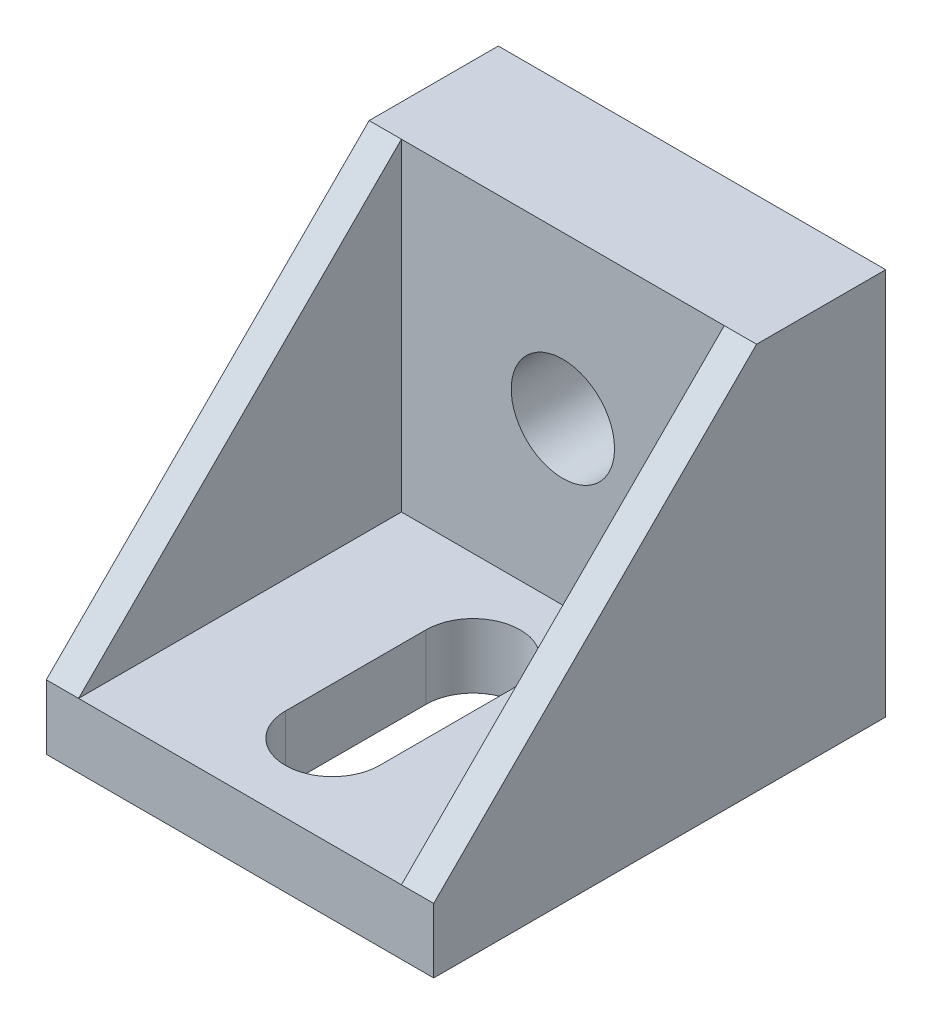
ISO-10303-21;
HEADER;
FILE_DESCRIPTION(('STEP AP214'),'2;1');
FILE_NAME('part.step','',(''),(''),'','','');
FILE_SCHEMA(('AUTOMOTIVE_DESIGN { 1 0 10303 214 1 1 1 1 }'));
ENDSEC;
DATA;
#1=APPLICATION_CONTEXT('core data for automotive mechanical design processes');
#2=APPLICATION_PROTOCOL_DEFINITION('international standard','automotive_design',2000,#1);
#3=PRODUCT_CONTEXT('',#1,'mechanical');
#4=PRODUCT('Part','Part','',(#3));
#5=PRODUCT_RELATED_PRODUCT_CATEGORY('part','',(#4));
#6=PRODUCT_DEFINITION_FORMATION('','',#4);
#7=PRODUCT_DEFINITION_CONTEXT('part definition',#1,'design');
#8=PRODUCT_DEFINITION('design','',#6,#7);
#9=PRODUCT_DEFINITION_SHAPE('','',#8);
#10=(LENGTH_UNIT() NAMED_UNIT(*) SI_UNIT(.MILLI.,.METRE.));
#11=(NAMED_UNIT(*) PLANE_ANGLE_UNIT() SI_UNIT($,.RADIAN.));
#12=(NAMED_UNIT(*) SI_UNIT($,.STERADIAN.) SOLID_ANGLE_UNIT());
#13=UNCERTAINTY_MEASURE_WITH_UNIT(LENGTH_MEASURE(1.E-05),#10,'distance_accuracy_value','');
#14=(GEOMETRIC_REPRESENTATION_CONTEXT(3) GLOBAL_UNCERTAINTY_ASSIGNED_CONTEXT((#13)) GLOBAL_UNIT_ASSIGNED_CONTEXT((#10,
#11,#12)) REPRESENTATION_CONTEXT('',''));
#15=CARTESIAN_POINT('',(0.,0.,0.));
#16=DIRECTION('',(0.,0.,1.));
#17=DIRECTION('',(1.,0.,0.));
#18=AXIS2_PLACEMENT_3D('',#15,#16,#17);
#19=CARTESIAN_POINT('',(0.,0.,10.));
#20=DIRECTION('',(0.,0.,1.));
#21=DIRECTION('',(1.,0.,0.));
#22=AXIS2_PLACEMENT_3D('',#19,#20,#21);
#23=PLANE('',#22);
#24=CARTESIAN_POINT('',(0.,0.,10.));
#25=DIRECTION('',(0.,0.,1.));
#26=DIRECTION('',(1.,0.,0.));
#27=AXIS2_PLACEMENT_3D('',#24,#25,#26);
#28=CIRCLE('',#27,4.);
#29=CARTESIAN_POINT('',(4.,0.,10.));
#30=VERTEX_POINT('',#29);
#31=EDGE_CURVE('E242',#30,#30,#28,.T.);
#32=ORIENTED_EDGE('',*,*,#31,.F.);
#33=EDGE_LOOP('',(#32));
#34=FACE_BOUND('',#33,.T.);
#35=DIRECTION('',(-1.,0.,0.));
#36=VECTOR('',#35,1.);
#37=CARTESIAN_POINT('',(-15.,12.5,10.));
#38=LINE('',#37,#36);
#39=CARTESIAN_POINT('',(12.5,12.5,10.));
#40=VERTEX_POINT('',#39);
#41=CARTESIAN_POINT('',(-12.5,12.5,10.));
#42=VERTEX_POINT('',#41);
#43=EDGE_CURVE('E254',#40,#42,#38,.T.);
#44=ORIENTED_EDGE('',*,*,#43,.T.);
#45=DIRECTION('',(0.,1.,0.));
#46=VECTOR('',#45,1.);
#47=CARTESIAN_POINT('',(-12.5,12.5,10.));
#48=LINE('',#47,#46);
#49=CARTESIAN_POINT('',(-12.5,-12.5,10.));
#50=VERTEX_POINT('',#49);
#51=EDGE_CURVE('E186',#50,#42,#48,.T.);
#52=ORIENTED_EDGE('',*,*,#51,.F.);
#53=DIRECTION('',(1.,0.,0.));
#54=VECTOR('',#53,1.);
#55=CARTESIAN_POINT('',(-15.,-12.5,10.));
#56=LINE('',#55,#54);
#57=CARTESIAN_POINT('',(12.5,-12.5,10.));
#58=VERTEX_POINT('',#57);
#59=EDGE_CURVE('E253',#50,#58,#56,.T.);
#60=ORIENTED_EDGE('',*,*,#59,.T.);
#61=DIRECTION('',(0.,1.,0.));
#62=VECTOR('',#61,1.);
#63=CARTESIAN_POINT('',(12.5,12.5,10.));
#64=LINE('',#63,#62);
#65=EDGE_CURVE('E203',#58,#40,#64,.T.);
#66=ORIENTED_EDGE('',*,*,#65,.T.);
#67=EDGE_LOOP('',(#44,#52,#60,#66));
#68=FACE_BOUND('',#67,.T.);
#69=ADVANCED_FACE('F39',(#34,#68),#23,.T.);
#70=CARTESIAN_POINT('',(0.,-12.5,0.));
#71=DIRECTION('',(0.,-1.,0.));
#72=DIRECTION('',(0.,0.,-1.));
#73=AXIS2_PLACEMENT_3D('',#70,#71,#72);
#74=PLANE('',#73);
#75=DIRECTION('',(0.,0.,-1.));
#76=VECTOR('',#75,1.);
#77=CARTESIAN_POINT('',(-3.64736353506313,-12.5,0.));
#78=LINE('',#77,#76);
#79=CARTESIAN_POINT('',(-3.64736353506313,-12.5,27.8421952869225));
#80=VERTEX_POINT('',#79);
#81=CARTESIAN_POINT('',(-3.64736353506313,-12.5,16.9480963071945));
#82=VERTEX_POINT('',#81);
#83=EDGE_CURVE('E160',#80,#82,#78,.T.);
#84=ORIENTED_EDGE('',*,*,#83,.T.);
#85=CARTESIAN_POINT('',(0.,-12.5,16.9480963071945));
#86=DIRECTION('',(0.,-1.,0.));
#87=DIRECTION('',(0.,0.,-1.));
#88=AXIS2_PLACEMENT_3D('',#85,#86,#87);
#89=CIRCLE('',#88,3.64736353506313);
#90=CARTESIAN_POINT('',(3.64736353506313,-12.5,16.9480963071945));
#91=VERTEX_POINT('',#90);
#92=EDGE_CURVE('E135',#82,#91,#89,.T.);
#93=ORIENTED_EDGE('',*,*,#92,.T.);
#94=DIRECTION('',(0.,0.,1.));
#95=VECTOR('',#94,1.);
#96=CARTESIAN_POINT('',(3.64736353506313,-12.5,0.));
#97=LINE('',#96,#95);
#98=CARTESIAN_POINT('',(3.64736353506313,-12.5,27.8421952869225));
#99=VERTEX_POINT('',#98);
#100=EDGE_CURVE('E173',#91,#99,#97,.T.);
#101=ORIENTED_EDGE('',*,*,#100,.T.);
#102=CARTESIAN_POINT('',(0.,-12.5,27.8421952869225));
#103=DIRECTION('',(0.,-1.,0.));
#104=DIRECTION('',(0.,0.,-1.));
#105=AXIS2_PLACEMENT_3D('',#102,#103,#104);
#106=CIRCLE('',#105,3.64736353506313);
#107=EDGE_CURVE('E169',#99,#80,#106,.T.);
#108=ORIENTED_EDGE('',*,*,#107,.T.);
#109=EDGE_LOOP('',(#84,#93,#101,#108));
#110=FACE_BOUND('',#109,.T.);
#111=DIRECTION('',(0.,0.,-1.));
#112=VECTOR('',#111,1.);
#113=CARTESIAN_POINT('',(-12.5,-12.5,10.));
#114=LINE('',#113,#112);
#115=CARTESIAN_POINT('',(-12.5,-12.5,35.));
#116=VERTEX_POINT('',#115);
#117=EDGE_CURVE('E180',#116,#50,#114,.T.);
#118=ORIENTED_EDGE('',*,*,#117,.F.);
#119=DIRECTION('',(-1.,0.,0.));
#120=VECTOR('',#119,1.);
#121=CARTESIAN_POINT('',(-15.,-12.5,35.));
#122=LINE('',#121,#120);
#123=CARTESIAN_POINT('',(12.5,-12.5,35.));
#124=VERTEX_POINT('',#123);
#125=EDGE_CURVE('E211',#124,#116,#122,.T.);
#126=ORIENTED_EDGE('',*,*,#125,.F.);
#127=DIRECTION('',(0.,0.,-1.));
#128=VECTOR('',#127,1.);
#129=CARTESIAN_POINT('',(12.5,-12.5,10.));
#130=LINE('',#129,#128);
#131=EDGE_CURVE('E199',#124,#58,#130,.T.);
#132=ORIENTED_EDGE('',*,*,#131,.T.);
#133=ORIENTED_EDGE('',*,*,#59,.F.);
#134=EDGE_LOOP('',(#118,#126,#132,#133));
#135=FACE_BOUND('',#134,.T.);
#136=ADVANCED_FACE('F296',(#110,#135),#74,.F.);
#137=CARTESIAN_POINT('',(0.,0.,0.));
#138=DIRECTION('',(0.,0.,1.));
#139=DIRECTION('',(1.,0.,0.));
#140=AXIS2_PLACEMENT_3D('',#137,#138,#139);
#141=PLANE('',#140);
#142=DIRECTION('',(0.,1.,0.));
#143=VECTOR('',#142,1.);
#144=CARTESIAN_POINT('',(15.,12.5,0.));
#145=LINE('',#144,#143);
#146=CARTESIAN_POINT('',(15.,-17.5,0.));
#147=VERTEX_POINT('',#146);
#148=CARTESIAN_POINT('',(15.,12.5,0.));
#149=VERTEX_POINT('',#148);
#150=EDGE_CURVE('E246',#147,#149,#145,.T.);
#151=ORIENTED_EDGE('',*,*,#150,.F.);
#152=DIRECTION('',(1.,0.,0.));
#153=VECTOR('',#152,1.);
#154=CARTESIAN_POINT('',(-15.,-17.5,0.));
#155=LINE('',#154,#153);
#156=CARTESIAN_POINT('',(-15.,-17.5,0.));
#157=VERTEX_POINT('',#156);
#158=EDGE_CURVE('E226',#157,#147,#155,.T.);
#159=ORIENTED_EDGE('',*,*,#158,.F.);
#160=DIRECTION('',(0.,-1.,0.));
#161=VECTOR('',#160,1.);
#162=CARTESIAN_POINT('',(-15.,12.5,0.));
#163=LINE('',#162,#161);
#164=CARTESIAN_POINT('',(-15.,12.5,0.));
#165=VERTEX_POINT('',#164);
#166=EDGE_CURVE('E263',#165,#157,#163,.T.);
#167=ORIENTED_EDGE('',*,*,#166,.F.);
#168=DIRECTION('',(-1.,0.,0.));
#169=VECTOR('',#168,1.);
#170=CARTESIAN_POINT('',(-15.,12.5,0.));
#171=LINE('',#170,#169);
#172=EDGE_CURVE('E260',#149,#165,#171,.T.);
#173=ORIENTED_EDGE('',*,*,#172,.F.);
#174=EDGE_LOOP('',(#151,#159,#167,#173));
#175=FACE_BOUND('',#174,.T.);
#176=CARTESIAN_POINT('',(0.,0.,0.));
#177=DIRECTION('',(0.,0.,1.));
#178=DIRECTION('',(1.,0.,0.));
#179=AXIS2_PLACEMENT_3D('',#176,#177,#178);
#180=CIRCLE('',#179,4.);
#181=CARTESIAN_POINT('',(4.,0.,0.));
#182=VERTEX_POINT('',#181);
#183=EDGE_CURVE('E241',#182,#182,#180,.T.);
#184=ORIENTED_EDGE('',*,*,#183,.T.);
#185=EDGE_LOOP('',(#184));
#186=FACE_BOUND('',#185,.T.);
#187=ADVANCED_FACE('F277',(#175,#186),#141,.F.);
#188=CARTESIAN_POINT('',(15.,12.5,10.));
#189=DIRECTION('',(-1.,0.,0.));
#190=DIRECTION('',(0.,-1.,0.));
#191=AXIS2_PLACEMENT_3D('',#188,#189,#190);
#192=PLANE('',#191);
#193=DIRECTION('',(0.,0.,-1.));
#194=VECTOR('',#193,1.);
#195=CARTESIAN_POINT('',(15.,12.5,10.));
#196=LINE('',#195,#194);
#197=CARTESIAN_POINT('',(15.,12.5,10.));
#198=VERTEX_POINT('',#197);
#199=EDGE_CURVE('E11',#198,#149,#196,.T.);
#200=ORIENTED_EDGE('',*,*,#199,.F.);
#201=DIRECTION('',(0.,-0.707106781186547,0.707106781186547));
#202=VECTOR('',#201,1.);
#203=CARTESIAN_POINT('',(15.,-12.5,35.));
#204=LINE('',#203,#202);
#205=CARTESIAN_POINT('',(15.,-12.5,35.));
#206=VERTEX_POINT('',#205);
#207=EDGE_CURVE('E195',#198,#206,#204,.T.);
#208=ORIENTED_EDGE('',*,*,#207,.T.);
#209=DIRECTION('',(0.,1.,0.));
#210=VECTOR('',#209,1.);
#211=CARTESIAN_POINT('',(15.,-17.5,35.));
#212=LINE('',#211,#210);
#213=CARTESIAN_POINT('',(15.,-17.5,35.));
#214=VERTEX_POINT('',#213);
#215=EDGE_CURVE('E237',#214,#206,#212,.T.);
#216=ORIENTED_EDGE('',*,*,#215,.F.);
#217=DIRECTION('',(0.,0.,1.));
#218=VECTOR('',#217,1.);
#219=CARTESIAN_POINT('',(15.,-17.5,35.));
#220=LINE('',#219,#218);
#221=EDGE_CURVE('E214',#147,#214,#220,.T.);
#222=ORIENTED_EDGE('',*,*,#221,.F.);
#223=ORIENTED_EDGE('',*,*,#150,.T.);
#224=EDGE_LOOP('',(#200,#208,#216,#222,#223));
#225=FACE_BOUND('',#224,.T.);
#226=ADVANCED_FACE('F41',(#225),#192,.F.);
#227=CARTESIAN_POINT('',(-15.,12.5,10.));
#228=DIRECTION('',(0.,-1.,0.));
#229=DIRECTION('',(0.,0.,-1.));
#230=AXIS2_PLACEMENT_3D('',#227,#228,#229);
#231=PLANE('',#230);
#232=ORIENTED_EDGE('',*,*,#172,.T.);
#233=DIRECTION('',(0.,0.,-1.));
#234=VECTOR('',#233,1.);
#235=CARTESIAN_POINT('',(-15.,12.5,10.));
#236=LINE('',#235,#234);
#237=CARTESIAN_POINT('',(-15.,12.5,10.));
#238=VERTEX_POINT('',#237);
#239=EDGE_CURVE('E48',#238,#165,#236,.T.);
#240=ORIENTED_EDGE('',*,*,#239,.F.);
#241=DIRECTION('',(-1.,0.,0.));
#242=VECTOR('',#241,1.);
#243=CARTESIAN_POINT('',(-12.5,12.5,10.));
#244=LINE('',#243,#242);
#245=EDGE_CURVE('E192',#42,#238,#244,.T.);
#246=ORIENTED_EDGE('',*,*,#245,.F.);
#247=ORIENTED_EDGE('',*,*,#43,.F.);
#248=EDGE_CURVE('E250',#198,#40,#38,.T.);
#249=ORIENTED_EDGE('',*,*,#248,.F.);
#250=ORIENTED_EDGE('',*,*,#199,.T.);
#251=EDGE_LOOP('',(#232,#240,#246,#247,#249,#250));
#252=FACE_BOUND('',#251,.T.);
#253=ADVANCED_FACE('F307',(#252),#231,.F.);
#254=CARTESIAN_POINT('',(-15.,12.5,10.));
#255=DIRECTION('',(1.,0.,0.));
#256=DIRECTION('',(0.,1.,0.));
#257=AXIS2_PLACEMENT_3D('',#254,#255,#256);
#258=PLANE('',#257);
#259=ORIENTED_EDGE('',*,*,#166,.T.);
#260=DIRECTION('',(0.,0.,-1.));
#261=VECTOR('',#260,1.);
#262=CARTESIAN_POINT('',(-15.,-17.5,35.));
#263=LINE('',#262,#261);
#264=CARTESIAN_POINT('',(-15.,-17.5,35.));
#265=VERTEX_POINT('',#264);
#266=EDGE_CURVE('E222',#265,#157,#263,.T.);
#267=ORIENTED_EDGE('',*,*,#266,.F.);
#268=DIRECTION('',(0.,1.,0.));
#269=VECTOR('',#268,1.);
#270=CARTESIAN_POINT('',(-15.,-17.5,35.));
#271=LINE('',#270,#269);
#272=CARTESIAN_POINT('',(-15.,-12.5,35.));
#273=VERTEX_POINT('',#272);
#274=EDGE_CURVE('E230',#265,#273,#271,.T.);
#275=ORIENTED_EDGE('',*,*,#274,.T.);
#276=DIRECTION('',(0.,-0.707106781186547,0.707106781186547));
#277=VECTOR('',#276,1.);
#278=CARTESIAN_POINT('',(-15.,-12.5,35.));
#279=LINE('',#278,#277);
#280=EDGE_CURVE('E179',#238,#273,#279,.T.);
#281=ORIENTED_EDGE('',*,*,#280,.F.);
#282=ORIENTED_EDGE('',*,*,#239,.T.);
#283=EDGE_LOOP('',(#259,#267,#275,#281,#282));
#284=FACE_BOUND('',#283,.T.);
#285=ADVANCED_FACE('F271',(#284),#258,.F.);
#286=CARTESIAN_POINT('',(0.,0.,10.));
#287=DIRECTION('',(0.,0.,-1.));
#288=DIRECTION('',(-1.,0.,0.));
#289=AXIS2_PLACEMENT_3D('',#286,#287,#288);
#290=CYLINDRICAL_SURFACE('',#289,4.);
#291=ORIENTED_EDGE('',*,*,#31,.T.);
#292=EDGE_LOOP('',(#291));
#293=FACE_BOUND('',#292,.T.);
#294=ORIENTED_EDGE('',*,*,#183,.F.);
#295=EDGE_LOOP('',(#294));
#296=FACE_BOUND('',#295,.T.);
#297=ADVANCED_FACE('F332',(#293,#296),#290,.F.);
#298=CARTESIAN_POINT('',(-15.,-17.5,35.));
#299=DIRECTION('',(0.,0.,-1.));
#300=DIRECTION('',(-1.,0.,0.));
#301=AXIS2_PLACEMENT_3D('',#298,#299,#300);
#302=PLANE('',#301);
#303=EDGE_CURVE('E219',#206,#124,#122,.T.);
#304=ORIENTED_EDGE('',*,*,#303,.T.);
#305=ORIENTED_EDGE('',*,*,#125,.T.);
#306=DIRECTION('',(-1.,0.,0.));
#307=VECTOR('',#306,1.);
#308=CARTESIAN_POINT('',(-12.5,-12.5,35.));
#309=LINE('',#308,#307);
#310=EDGE_CURVE('E189',#116,#273,#309,.T.);
#311=ORIENTED_EDGE('',*,*,#310,.T.);
#312=ORIENTED_EDGE('',*,*,#274,.F.);
#313=DIRECTION('',(-1.,0.,0.));
#314=VECTOR('',#313,1.);
#315=CARTESIAN_POINT('',(-15.,-17.5,35.));
#316=LINE('',#315,#314);
#317=EDGE_CURVE('E218',#214,#265,#316,.T.);
#318=ORIENTED_EDGE('',*,*,#317,.F.);
#319=ORIENTED_EDGE('',*,*,#215,.T.);
#320=EDGE_LOOP('',(#304,#305,#311,#312,#318,#319));
#321=FACE_BOUND('',#320,.T.);
#322=ADVANCED_FACE('F285',(#321),#302,.F.);
#323=CARTESIAN_POINT('',(0.,-17.5,0.));
#324=DIRECTION('',(0.,-1.,0.));
#325=DIRECTION('',(0.,0.,-1.));
#326=AXIS2_PLACEMENT_3D('',#323,#324,#325);
#327=PLANE('',#326);
#328=CARTESIAN_POINT('',(0.,-17.5,16.9480963071945));
#329=DIRECTION('',(0.,1.,0.));
#330=DIRECTION('',(0.,0.,1.));
#331=AXIS2_PLACEMENT_3D('',#328,#329,#330);
#332=CIRCLE('',#331,3.64736353506313);
#333=CARTESIAN_POINT('',(3.64736353506313,-17.5,16.9480963071945));
#334=VERTEX_POINT('',#333);
#335=CARTESIAN_POINT('',(-3.64736353506313,-17.5,16.9480963071945));
#336=VERTEX_POINT('',#335);
#337=EDGE_CURVE('E132',#334,#336,#332,.T.);
#338=ORIENTED_EDGE('',*,*,#337,.T.);
#339=DIRECTION('',(0.,0.,1.));
#340=VECTOR('',#339,1.);
#341=CARTESIAN_POINT('',(-3.64736353506313,-17.5,16.9480963071945));
#342=LINE('',#341,#340);
#343=CARTESIAN_POINT('',(-3.64736353506313,-17.5,27.8421952869225));
#344=VERTEX_POINT('',#343);
#345=EDGE_CURVE('E142',#336,#344,#342,.T.);
#346=ORIENTED_EDGE('',*,*,#345,.T.);
#347=CARTESIAN_POINT('',(0.,-17.5,27.8421952869225));
#348=DIRECTION('',(0.,1.,0.));
#349=DIRECTION('',(0.,0.,1.));
#350=AXIS2_PLACEMENT_3D('',#347,#348,#349);
#351=CIRCLE('',#350,3.64736353506313);
#352=CARTESIAN_POINT('',(3.64736353506313,-17.5,27.8421952869225));
#353=VERTEX_POINT('',#352);
#354=EDGE_CURVE('E63',#344,#353,#351,.T.);
#355=ORIENTED_EDGE('',*,*,#354,.T.);
#356=DIRECTION('',(0.,0.,-1.));
#357=VECTOR('',#356,1.);
#358=CARTESIAN_POINT('',(3.64736353506313,-17.5,16.9480963071945));
#359=LINE('',#358,#357);
#360=EDGE_CURVE('E139',#353,#334,#359,.T.);
#361=ORIENTED_EDGE('',*,*,#360,.T.);
#362=EDGE_LOOP('',(#338,#346,#355,#361));
#363=FACE_BOUND('',#362,.T.);
#364=ORIENTED_EDGE('',*,*,#221,.T.);
#365=ORIENTED_EDGE('',*,*,#317,.T.);
#366=ORIENTED_EDGE('',*,*,#266,.T.);
#367=ORIENTED_EDGE('',*,*,#158,.T.);
#368=EDGE_LOOP('',(#364,#365,#366,#367));
#369=FACE_BOUND('',#368,.T.);
#370=ADVANCED_FACE('F147',(#363,#369),#327,.T.);
#371=CARTESIAN_POINT('',(12.5,-12.5,35.));
#372=DIRECTION('',(0.,0.707106781186548,0.707106781186548));
#373=DIRECTION('',(0.,-0.707106781186548,0.707106781186548));
#374=AXIS2_PLACEMENT_3D('',#371,#372,#373);
#375=PLANE('',#374);
#376=ORIENTED_EDGE('',*,*,#207,.F.);
#377=ORIENTED_EDGE('',*,*,#248,.T.);
#378=DIRECTION('',(0.,-0.707106781186547,0.707106781186547));
#379=VECTOR('',#378,1.);
#380=CARTESIAN_POINT('',(12.5,-12.5,35.));
#381=LINE('',#380,#379);
#382=EDGE_CURVE('E207',#40,#124,#381,.T.);
#383=ORIENTED_EDGE('',*,*,#382,.T.);
#384=ORIENTED_EDGE('',*,*,#303,.F.);
#385=EDGE_LOOP('',(#376,#377,#383,#384));
#386=FACE_BOUND('',#385,.T.);
#387=ADVANCED_FACE('F310',(#386),#375,.T.);
#388=CARTESIAN_POINT('',(12.5,0.,0.));
#389=DIRECTION('',(1.,0.,0.));
#390=DIRECTION('',(0.,1.,0.));
#391=AXIS2_PLACEMENT_3D('',#388,#389,#390);
#392=PLANE('',#391);
#393=ORIENTED_EDGE('',*,*,#131,.F.);
#394=ORIENTED_EDGE('',*,*,#382,.F.);
#395=ORIENTED_EDGE('',*,*,#65,.F.);
#396=EDGE_LOOP('',(#393,#394,#395));
#397=FACE_BOUND('',#396,.T.);
#398=ADVANCED_FACE('F312',(#397),#392,.F.);
#399=CARTESIAN_POINT('',(-12.5,-12.5,35.));
#400=DIRECTION('',(0.,-0.707106781186548,-0.707106781186548));
#401=DIRECTION('',(0.,0.707106781186548,-0.707106781186548));
#402=AXIS2_PLACEMENT_3D('',#399,#400,#401);
#403=PLANE('',#402);
#404=ORIENTED_EDGE('',*,*,#280,.T.);
#405=ORIENTED_EDGE('',*,*,#310,.F.);
#406=DIRECTION('',(0.,-0.707106781186547,0.707106781186547));
#407=VECTOR('',#406,1.);
#408=CARTESIAN_POINT('',(-12.5,-12.5,35.));
#409=LINE('',#408,#407);
#410=EDGE_CURVE('E183',#42,#116,#409,.T.);
#411=ORIENTED_EDGE('',*,*,#410,.F.);
#412=ORIENTED_EDGE('',*,*,#245,.T.);
#413=EDGE_LOOP('',(#404,#405,#411,#412));
#414=FACE_BOUND('',#413,.T.);
#415=ADVANCED_FACE('F293',(#414),#403,.F.);
#416=CARTESIAN_POINT('',(-12.5,0.,0.));
#417=DIRECTION('',(-1.,0.,0.));
#418=DIRECTION('',(0.,1.,0.));
#419=AXIS2_PLACEMENT_3D('',#416,#417,#418);
#420=PLANE('',#419);
#421=ORIENTED_EDGE('',*,*,#117,.T.);
#422=ORIENTED_EDGE('',*,*,#51,.T.);
#423=ORIENTED_EDGE('',*,*,#410,.T.);
#424=EDGE_LOOP('',(#421,#422,#423));
#425=FACE_BOUND('',#424,.T.);
#426=ADVANCED_FACE('F299',(#425),#420,.F.);
#427=CARTESIAN_POINT('',(0.,-17.5,16.9480963071945));
#428=DIRECTION('',(0.,1.,0.));
#429=DIRECTION('',(0.,0.,1.));
#430=AXIS2_PLACEMENT_3D('',#427,#428,#429);
#431=CYLINDRICAL_SURFACE('',#430,3.64736353506313);
#432=DIRECTION('',(0.,1.,0.));
#433=VECTOR('',#432,1.);
#434=CARTESIAN_POINT('',(-3.64736353506313,-17.5,16.9480963071945));
#435=LINE('',#434,#433);
#436=EDGE_CURVE('E55',#336,#82,#435,.T.);
#437=ORIENTED_EDGE('',*,*,#436,.F.);
#438=ORIENTED_EDGE('',*,*,#337,.F.);
#439=DIRECTION('',(0.,1.,0.));
#440=VECTOR('',#439,1.);
#441=CARTESIAN_POINT('',(3.64736353506313,-17.5,16.9480963071945));
#442=LINE('',#441,#440);
#443=EDGE_CURVE('E157',#334,#91,#442,.T.);
#444=ORIENTED_EDGE('',*,*,#443,.T.);
#445=ORIENTED_EDGE('',*,*,#92,.F.);
#446=EDGE_LOOP('',(#437,#438,#444,#445));
#447=FACE_BOUND('',#446,.T.);
#448=ADVANCED_FACE('F129',(#447),#431,.F.);
#449=CARTESIAN_POINT('',(3.64736353506313,-17.5,16.9480963071945));
#450=DIRECTION('',(1.,0.,0.));
#451=DIRECTION('',(0.,0.,-1.));
#452=AXIS2_PLACEMENT_3D('',#449,#450,#451);
#453=PLANE('',#452);
#454=ORIENTED_EDGE('',*,*,#443,.F.);
#455=ORIENTED_EDGE('',*,*,#360,.F.);
#456=DIRECTION('',(0.,1.,0.));
#457=VECTOR('',#456,1.);
#458=CARTESIAN_POINT('',(3.64736353506313,-17.5,27.8421952869225));
#459=LINE('',#458,#457);
#460=EDGE_CURVE('E161',#353,#99,#459,.T.);
#461=ORIENTED_EDGE('',*,*,#460,.T.);
#462=ORIENTED_EDGE('',*,*,#100,.F.);
#463=EDGE_LOOP('',(#454,#455,#461,#462));
#464=FACE_BOUND('',#463,.T.);
#465=ADVANCED_FACE('F379',(#464),#453,.F.);
#466=CARTESIAN_POINT('',(0.,-17.5,27.8421952869225));
#467=DIRECTION('',(0.,1.,0.));
#468=DIRECTION('',(0.,0.,1.));
#469=AXIS2_PLACEMENT_3D('',#466,#467,#468);
#470=CYLINDRICAL_SURFACE('',#469,3.64736353506313);
#471=ORIENTED_EDGE('',*,*,#460,.F.);
#472=ORIENTED_EDGE('',*,*,#354,.F.);
#473=DIRECTION('',(0.,1.,0.));
#474=VECTOR('',#473,1.);
#475=CARTESIAN_POINT('',(-3.64736353506313,-17.5,27.8421952869225));
#476=LINE('',#475,#474);
#477=EDGE_CURVE('E138',#344,#80,#476,.T.);
#478=ORIENTED_EDGE('',*,*,#477,.T.);
#479=ORIENTED_EDGE('',*,*,#107,.F.);
#480=EDGE_LOOP('',(#471,#472,#478,#479));
#481=FACE_BOUND('',#480,.T.);
#482=ADVANCED_FACE('F388',(#481),#470,.F.);
#483=CARTESIAN_POINT('',(-3.64736353506313,-17.5,16.9480963071945));
#484=DIRECTION('',(-1.,0.,0.));
#485=DIRECTION('',(0.,0.,1.));
#486=AXIS2_PLACEMENT_3D('',#483,#484,#485);
#487=PLANE('',#486);
#488=ORIENTED_EDGE('',*,*,#477,.F.);
#489=ORIENTED_EDGE('',*,*,#345,.F.);
#490=ORIENTED_EDGE('',*,*,#436,.T.);
#491=ORIENTED_EDGE('',*,*,#83,.F.);
#492=EDGE_LOOP('',(#488,#489,#490,#491));
#493=FACE_BOUND('',#492,.T.);
#494=ADVANCED_FACE('F143',(#493),#487,.F.);
#495=CLOSED_SHELL('',(#69,#136,#187,#226,#253,#285,#297,#322,#370,#387,#398,#415,#426,#448,#465,
#482,#494));
#496=MANIFOLD_SOLID_BREP('B2',#495);
#497=ADVANCED_BREP_SHAPE_REPRESENTATION('',(#18,#496),#14);
#498=SHAPE_DEFINITION_REPRESENTATION(#9,#497);
ENDSEC;
END-ISO-10303-21;
